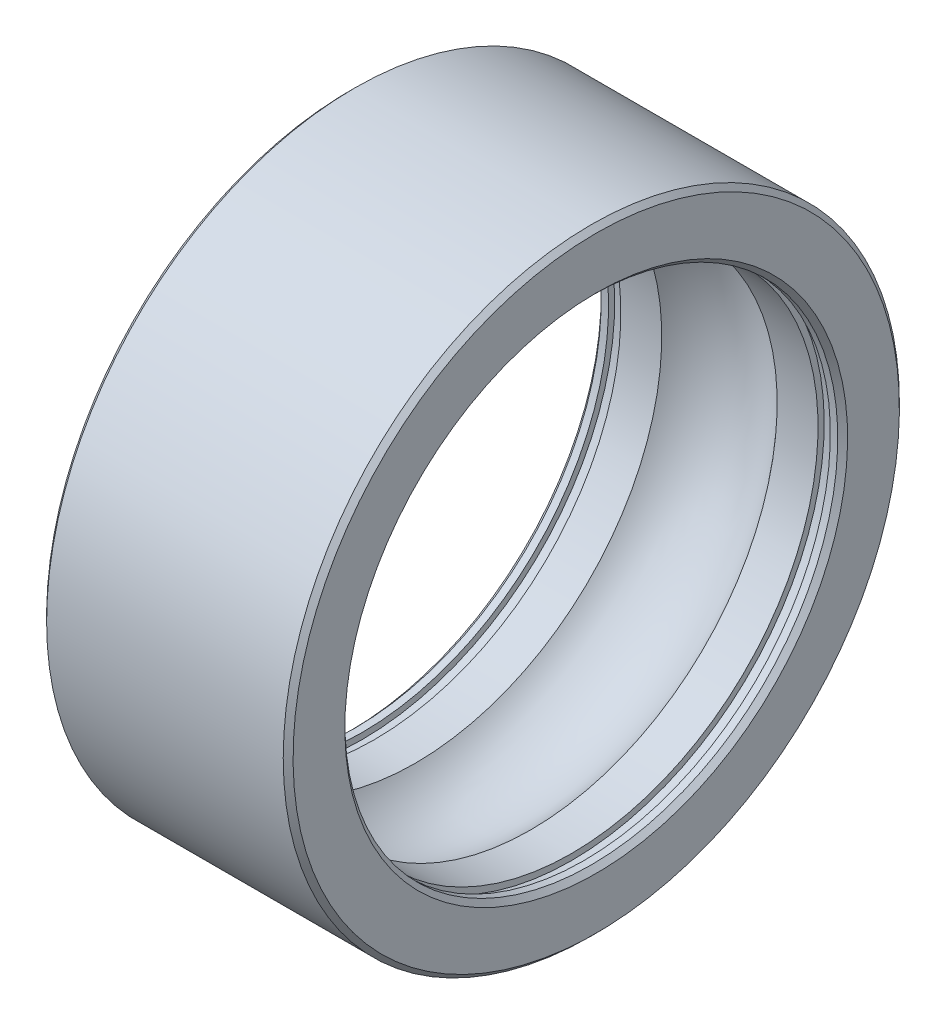
ISO-10303-21;
HEADER;
FILE_DESCRIPTION(('STEP AP214'),'2;1');
FILE_NAME('part.step','',(''),(''),'','','');
FILE_SCHEMA(('AUTOMOTIVE_DESIGN { 1 0 10303 214 1 1 1 1 }'));
ENDSEC;
DATA;
#1=APPLICATION_CONTEXT('core data for automotive mechanical design processes');
#2=APPLICATION_PROTOCOL_DEFINITION('international standard','automotive_design',2000,#1);
#3=PRODUCT_CONTEXT('',#1,'mechanical');
#4=PRODUCT('Part','Part','',(#3));
#5=PRODUCT_RELATED_PRODUCT_CATEGORY('part','',(#4));
#6=PRODUCT_DEFINITION_FORMATION('','',#4);
#7=PRODUCT_DEFINITION_CONTEXT('part definition',#1,'design');
#8=PRODUCT_DEFINITION('design','',#6,#7);
#9=PRODUCT_DEFINITION_SHAPE('','',#8);
#10=(LENGTH_UNIT() NAMED_UNIT(*) SI_UNIT(.MILLI.,.METRE.));
#11=(NAMED_UNIT(*) PLANE_ANGLE_UNIT() SI_UNIT($,.RADIAN.));
#12=(NAMED_UNIT(*) SI_UNIT($,.STERADIAN.) SOLID_ANGLE_UNIT());
#13=UNCERTAINTY_MEASURE_WITH_UNIT(LENGTH_MEASURE(1.E-05),#10,'distance_accuracy_value','');
#14=(GEOMETRIC_REPRESENTATION_CONTEXT(3) GLOBAL_UNCERTAINTY_ASSIGNED_CONTEXT((#13)) GLOBAL_UNIT_ASSIGNED_CONTEXT((#10,
#11,#12)) REPRESENTATION_CONTEXT('',''));
#15=CARTESIAN_POINT('',(0.,0.,0.));
#16=DIRECTION('',(0.,0.,1.));
#17=DIRECTION('',(1.,0.,0.));
#18=AXIS2_PLACEMENT_3D('',#15,#16,#17);
#19=CARTESIAN_POINT('',(1.8,-4.1,0.));
#20=DIRECTION('',(-1.,0.,0.));
#21=DIRECTION('',(0.,-1.,0.));
#22=AXIS2_PLACEMENT_3D('',#19,#20,#21);
#23=PLANE('',#22);
#24=CARTESIAN_POINT('',(1.8,0.,0.));
#25=DIRECTION('',(-1.,0.,0.));
#26=DIRECTION('',(0.,-1.,0.));
#27=AXIS2_PLACEMENT_3D('',#24,#25,#26);
#28=CIRCLE('',#27,4.1);
#29=CARTESIAN_POINT('',(1.8,-4.1,0.));
#30=VERTEX_POINT('',#29);
#31=EDGE_CURVE('E62',#30,#30,#28,.T.);
#32=ORIENTED_EDGE('',*,*,#31,.T.);
#33=EDGE_LOOP('',(#32));
#34=FACE_BOUND('',#33,.T.);
#35=CARTESIAN_POINT('',(1.8,0.,0.));
#36=DIRECTION('',(-1.,0.,0.));
#37=DIRECTION('',(0.,-1.,0.));
#38=AXIS2_PLACEMENT_3D('',#35,#36,#37);
#39=CIRCLE('',#38,4.);
#40=CARTESIAN_POINT('',(1.8,-4.,0.));
#41=VERTEX_POINT('',#40);
#42=EDGE_CURVE('E89',#41,#41,#39,.T.);
#43=ORIENTED_EDGE('',*,*,#42,.F.);
#44=EDGE_LOOP('',(#43));
#45=FACE_BOUND('',#44,.T.);
#46=ADVANCED_FACE('F30',(#34,#45),#23,.T.);
#47=CARTESIAN_POINT('',(-6.42901749222422,0.,0.));
#48=DIRECTION('',(-1.,0.,0.));
#49=DIRECTION('',(0.,-1.,0.));
#50=AXIS2_PLACEMENT_3D('',#47,#48,#49);
#51=CYLINDRICAL_SURFACE('',#50,4.1);
#52=CARTESIAN_POINT('',(1.6,0.,0.));
#53=DIRECTION('',(-1.,0.,0.));
#54=DIRECTION('',(0.,-1.,0.));
#55=AXIS2_PLACEMENT_3D('',#52,#53,#54);
#56=CIRCLE('',#55,4.1);
#57=CARTESIAN_POINT('',(1.6,-4.1,0.));
#58=VERTEX_POINT('',#57);
#59=EDGE_CURVE('E65',#58,#58,#56,.T.);
#60=ORIENTED_EDGE('',*,*,#59,.T.);
#61=EDGE_LOOP('',(#60));
#62=FACE_BOUND('',#61,.T.);
#63=ORIENTED_EDGE('',*,*,#31,.F.);
#64=EDGE_LOOP('',(#63));
#65=FACE_BOUND('',#64,.T.);
#66=ADVANCED_FACE('F96',(#62,#65),#51,.F.);
#67=CARTESIAN_POINT('',(1.6,-4.,0.));
#68=DIRECTION('',(1.,0.,0.));
#69=DIRECTION('',(0.,1.,0.));
#70=AXIS2_PLACEMENT_3D('',#67,#68,#69);
#71=PLANE('',#70);
#72=CARTESIAN_POINT('',(1.6,0.,0.));
#73=DIRECTION('',(-1.,0.,0.));
#74=DIRECTION('',(0.,-1.,0.));
#75=AXIS2_PLACEMENT_3D('',#72,#73,#74);
#76=CIRCLE('',#75,4.);
#77=CARTESIAN_POINT('',(1.6,-4.,0.));
#78=VERTEX_POINT('',#77);
#79=EDGE_CURVE('E68',#78,#78,#76,.T.);
#80=ORIENTED_EDGE('',*,*,#79,.T.);
#81=EDGE_LOOP('',(#80));
#82=FACE_BOUND('',#81,.T.);
#83=ORIENTED_EDGE('',*,*,#59,.F.);
#84=EDGE_LOOP('',(#83));
#85=FACE_BOUND('',#84,.T.);
#86=ADVANCED_FACE('F102',(#82,#85),#71,.T.);
#87=CARTESIAN_POINT('',(-6.42901749222422,0.,0.));
#88=DIRECTION('',(-1.,0.,0.));
#89=DIRECTION('',(0.,-1.,0.));
#90=AXIS2_PLACEMENT_3D('',#87,#88,#89);
#91=CYLINDRICAL_SURFACE('',#90,4.);
#92=CARTESIAN_POINT('',(0.936749699759759,0.,0.));
#93=DIRECTION('',(-1.,0.,0.));
#94=DIRECTION('',(0.,-1.,0.));
#95=AXIS2_PLACEMENT_3D('',#92,#93,#94);
#96=CIRCLE('',#95,4.);
#97=CARTESIAN_POINT('',(0.936749699759759,-4.,0.));
#98=VERTEX_POINT('',#97);
#99=EDGE_CURVE('E71',#98,#98,#96,.T.);
#100=ORIENTED_EDGE('',*,*,#99,.T.);
#101=EDGE_LOOP('',(#100));
#102=FACE_BOUND('',#101,.T.);
#103=ORIENTED_EDGE('',*,*,#79,.F.);
#104=EDGE_LOOP('',(#103));
#105=FACE_BOUND('',#104,.T.);
#106=ADVANCED_FACE('F164',(#102,#105),#91,.F.);
#107=CARTESIAN_POINT('',(0.,0.,0.));
#108=DIRECTION('',(-1.,0.,0.));
#109=DIRECTION('',(0.,-1.,0.));
#110=AXIS2_PLACEMENT_3D('',#107,#108,#109);
#111=TOROIDAL_SURFACE('',#110,3.25,1.2);
#112=CARTESIAN_POINT('',(-0.93674969975976,0.,0.));
#113=DIRECTION('',(-1.,0.,0.));
#114=DIRECTION('',(0.,-1.,0.));
#115=AXIS2_PLACEMENT_3D('',#112,#113,#114);
#116=CIRCLE('',#115,4.);
#117=CARTESIAN_POINT('',(-0.93674969975976,-4.,0.));
#118=VERTEX_POINT('',#117);
#119=EDGE_CURVE('E74',#118,#118,#116,.T.);
#120=ORIENTED_EDGE('',*,*,#119,.T.);
#121=EDGE_LOOP('',(#120));
#122=FACE_BOUND('',#121,.T.);
#123=ORIENTED_EDGE('',*,*,#99,.F.);
#124=EDGE_LOOP('',(#123));
#125=FACE_BOUND('',#124,.T.);
#126=ADVANCED_FACE('F160',(#122,#125),#111,.F.);
#127=CARTESIAN_POINT('',(-6.42901749222422,0.,0.));
#128=DIRECTION('',(-1.,0.,0.));
#129=DIRECTION('',(0.,-1.,0.));
#130=AXIS2_PLACEMENT_3D('',#127,#128,#129);
#131=CYLINDRICAL_SURFACE('',#130,4.);
#132=CARTESIAN_POINT('',(-1.6,0.,0.));
#133=DIRECTION('',(-1.,0.,0.));
#134=DIRECTION('',(0.,-1.,0.));
#135=AXIS2_PLACEMENT_3D('',#132,#133,#134);
#136=CIRCLE('',#135,4.);
#137=CARTESIAN_POINT('',(-1.6,-4.,0.));
#138=VERTEX_POINT('',#137);
#139=EDGE_CURVE('E77',#138,#138,#136,.T.);
#140=ORIENTED_EDGE('',*,*,#139,.T.);
#141=EDGE_LOOP('',(#140));
#142=FACE_BOUND('',#141,.T.);
#143=ORIENTED_EDGE('',*,*,#119,.F.);
#144=EDGE_LOOP('',(#143));
#145=FACE_BOUND('',#144,.T.);
#146=ADVANCED_FACE('F156',(#142,#145),#131,.F.);
#147=CARTESIAN_POINT('',(-1.6,-4.,0.));
#148=DIRECTION('',(-1.,0.,0.));
#149=DIRECTION('',(0.,-1.,0.));
#150=AXIS2_PLACEMENT_3D('',#147,#148,#149);
#151=PLANE('',#150);
#152=CARTESIAN_POINT('',(-1.6,0.,0.));
#153=DIRECTION('',(-1.,0.,0.));
#154=DIRECTION('',(0.,-1.,0.));
#155=AXIS2_PLACEMENT_3D('',#152,#153,#154);
#156=CIRCLE('',#155,4.1);
#157=CARTESIAN_POINT('',(-1.6,-4.1,0.));
#158=VERTEX_POINT('',#157);
#159=EDGE_CURVE('E80',#158,#158,#156,.T.);
#160=ORIENTED_EDGE('',*,*,#159,.T.);
#161=EDGE_LOOP('',(#160));
#162=FACE_BOUND('',#161,.T.);
#163=ORIENTED_EDGE('',*,*,#139,.F.);
#164=EDGE_LOOP('',(#163));
#165=FACE_BOUND('',#164,.T.);
#166=ADVANCED_FACE('F152',(#162,#165),#151,.T.);
#167=CARTESIAN_POINT('',(-6.42901749222422,0.,0.));
#168=DIRECTION('',(-1.,0.,0.));
#169=DIRECTION('',(0.,-1.,0.));
#170=AXIS2_PLACEMENT_3D('',#167,#168,#169);
#171=CYLINDRICAL_SURFACE('',#170,4.1);
#172=CARTESIAN_POINT('',(-1.8,0.,0.));
#173=DIRECTION('',(-1.,0.,0.));
#174=DIRECTION('',(0.,-1.,0.));
#175=AXIS2_PLACEMENT_3D('',#172,#173,#174);
#176=CIRCLE('',#175,4.1);
#177=CARTESIAN_POINT('',(-1.8,-4.1,0.));
#178=VERTEX_POINT('',#177);
#179=EDGE_CURVE('E83',#178,#178,#176,.T.);
#180=ORIENTED_EDGE('',*,*,#179,.T.);
#181=EDGE_LOOP('',(#180));
#182=FACE_BOUND('',#181,.T.);
#183=ORIENTED_EDGE('',*,*,#159,.F.);
#184=EDGE_LOOP('',(#183));
#185=FACE_BOUND('',#184,.T.);
#186=ADVANCED_FACE('F148',(#182,#185),#171,.F.);
#187=CARTESIAN_POINT('',(-1.8,-4.1,0.));
#188=DIRECTION('',(1.,0.,0.));
#189=DIRECTION('',(0.,1.,0.));
#190=AXIS2_PLACEMENT_3D('',#187,#188,#189);
#191=PLANE('',#190);
#192=CARTESIAN_POINT('',(-1.8,0.,0.));
#193=DIRECTION('',(-1.,0.,0.));
#194=DIRECTION('',(0.,-1.,0.));
#195=AXIS2_PLACEMENT_3D('',#192,#193,#194);
#196=CIRCLE('',#195,4.);
#197=CARTESIAN_POINT('',(-1.8,-4.,0.));
#198=VERTEX_POINT('',#197);
#199=EDGE_CURVE('E86',#198,#198,#196,.T.);
#200=ORIENTED_EDGE('',*,*,#199,.T.);
#201=EDGE_LOOP('',(#200));
#202=FACE_BOUND('',#201,.T.);
#203=ORIENTED_EDGE('',*,*,#179,.F.);
#204=EDGE_LOOP('',(#203));
#205=FACE_BOUND('',#204,.T.);
#206=ADVANCED_FACE('F144',(#202,#205),#191,.T.);
#207=CARTESIAN_POINT('',(-6.42901749222422,0.,0.));
#208=DIRECTION('',(-1.,0.,0.));
#209=DIRECTION('',(0.,-1.,0.));
#210=AXIS2_PLACEMENT_3D('',#207,#208,#209);
#211=CYLINDRICAL_SURFACE('',#210,4.);
#212=CARTESIAN_POINT('',(-1.92,0.,0.));
#213=DIRECTION('',(-1.,0.,0.));
#214=DIRECTION('',(0.,-1.,0.));
#215=AXIS2_PLACEMENT_3D('',#212,#213,#214);
#216=CIRCLE('',#215,4.);
#217=CARTESIAN_POINT('',(-1.92,-4.,0.));
#218=VERTEX_POINT('',#217);
#219=EDGE_CURVE('E50',#218,#218,#216,.T.);
#220=ORIENTED_EDGE('',*,*,#219,.T.);
#221=EDGE_LOOP('',(#220));
#222=FACE_BOUND('',#221,.T.);
#223=ORIENTED_EDGE('',*,*,#199,.F.);
#224=EDGE_LOOP('',(#223));
#225=FACE_BOUND('',#224,.T.);
#226=ADVANCED_FACE('F140',(#222,#225),#211,.F.);
#227=CARTESIAN_POINT('',(-2.,-4.,0.));
#228=DIRECTION('',(-1.,0.,0.));
#229=DIRECTION('',(0.,-1.,0.));
#230=AXIS2_PLACEMENT_3D('',#227,#228,#229);
#231=PLANE('',#230);
#232=CARTESIAN_POINT('',(-2.,0.,0.));
#233=DIRECTION('',(-1.,0.,0.));
#234=DIRECTION('',(0.,-1.,0.));
#235=AXIS2_PLACEMENT_3D('',#232,#233,#234);
#236=CIRCLE('',#235,4.08);
#237=CARTESIAN_POINT('',(-2.,-4.08,0.));
#238=VERTEX_POINT('',#237);
#239=EDGE_CURVE('E41',#238,#238,#236,.F.);
#240=ORIENTED_EDGE('',*,*,#239,.T.);
#241=EDGE_LOOP('',(#240));
#242=FACE_BOUND('',#241,.T.);
#243=CARTESIAN_POINT('',(-2.,0.,0.));
#244=DIRECTION('',(-1.,0.,0.));
#245=DIRECTION('',(0.,-1.,0.));
#246=AXIS2_PLACEMENT_3D('',#243,#244,#245);
#247=CIRCLE('',#246,4.91999999999999);
#248=CARTESIAN_POINT('',(-2.,-4.91999999999999,0.));
#249=VERTEX_POINT('',#248);
#250=EDGE_CURVE('E45',#249,#249,#247,.T.);
#251=ORIENTED_EDGE('',*,*,#250,.T.);
#252=EDGE_LOOP('',(#251));
#253=FACE_BOUND('',#252,.T.);
#254=ADVANCED_FACE('F135',(#242,#253),#231,.T.);
#255=CARTESIAN_POINT('',(-6.42901749222422,0.,0.));
#256=DIRECTION('',(-1.,0.,0.));
#257=DIRECTION('',(0.,-1.,0.));
#258=AXIS2_PLACEMENT_3D('',#255,#256,#257);
#259=CYLINDRICAL_SURFACE('',#258,5.);
#260=CARTESIAN_POINT('',(1.92,0.,0.));
#261=DIRECTION('',(1.,0.,0.));
#262=DIRECTION('',(0.,1.,0.));
#263=AXIS2_PLACEMENT_3D('',#260,#261,#262);
#264=CIRCLE('',#263,5.);
#265=CARTESIAN_POINT('',(1.92,5.,0.));
#266=VERTEX_POINT('',#265);
#267=EDGE_CURVE('E10',#266,#266,#264,.F.);
#268=ORIENTED_EDGE('',*,*,#267,.T.);
#269=EDGE_LOOP('',(#268));
#270=FACE_BOUND('',#269,.T.);
#271=CARTESIAN_POINT('',(-1.91999999999999,0.,0.));
#272=DIRECTION('',(-1.,0.,0.));
#273=DIRECTION('',(0.,-1.,0.));
#274=AXIS2_PLACEMENT_3D('',#271,#272,#273);
#275=CIRCLE('',#274,5.);
#276=CARTESIAN_POINT('',(-1.91999999999999,-5.,0.));
#277=VERTEX_POINT('',#276);
#278=EDGE_CURVE('E37',#277,#277,#275,.F.);
#279=ORIENTED_EDGE('',*,*,#278,.T.);
#280=EDGE_LOOP('',(#279));
#281=FACE_BOUND('',#280,.T.);
#282=ADVANCED_FACE('F126',(#270,#281),#259,.T.);
#283=CARTESIAN_POINT('',(2.,-4.,0.));
#284=DIRECTION('',(1.,0.,0.));
#285=DIRECTION('',(0.,1.,0.));
#286=AXIS2_PLACEMENT_3D('',#283,#284,#285);
#287=PLANE('',#286);
#288=CARTESIAN_POINT('',(2.,0.,0.));
#289=DIRECTION('',(1.,0.,0.));
#290=DIRECTION('',(0.,1.,0.));
#291=AXIS2_PLACEMENT_3D('',#288,#289,#290);
#292=CIRCLE('',#291,4.08);
#293=CARTESIAN_POINT('',(2.,4.08,0.));
#294=VERTEX_POINT('',#293);
#295=EDGE_CURVE('E56',#294,#294,#292,.F.);
#296=ORIENTED_EDGE('',*,*,#295,.T.);
#297=EDGE_LOOP('',(#296));
#298=FACE_BOUND('',#297,.T.);
#299=CARTESIAN_POINT('',(2.,0.,0.));
#300=DIRECTION('',(1.,0.,0.));
#301=DIRECTION('',(0.,1.,0.));
#302=AXIS2_PLACEMENT_3D('',#299,#300,#301);
#303=CIRCLE('',#302,4.92);
#304=CARTESIAN_POINT('',(2.,4.92,0.));
#305=VERTEX_POINT('',#304);
#306=EDGE_CURVE('E59',#305,#305,#303,.T.);
#307=ORIENTED_EDGE('',*,*,#306,.T.);
#308=EDGE_LOOP('',(#307));
#309=FACE_BOUND('',#308,.T.);
#310=ADVANCED_FACE('F124',(#298,#309),#287,.T.);
#311=CARTESIAN_POINT('',(-6.42901749222422,0.,0.));
#312=DIRECTION('',(-1.,0.,0.));
#313=DIRECTION('',(0.,-1.,0.));
#314=AXIS2_PLACEMENT_3D('',#311,#312,#313);
#315=CYLINDRICAL_SURFACE('',#314,4.);
#316=CARTESIAN_POINT('',(1.92,0.,0.));
#317=DIRECTION('',(1.,0.,0.));
#318=DIRECTION('',(0.,1.,0.));
#319=AXIS2_PLACEMENT_3D('',#316,#317,#318);
#320=CIRCLE('',#319,4.);
#321=CARTESIAN_POINT('',(1.92,4.,0.));
#322=VERTEX_POINT('',#321);
#323=EDGE_CURVE('E53',#322,#322,#320,.T.);
#324=ORIENTED_EDGE('',*,*,#323,.T.);
#325=EDGE_LOOP('',(#324));
#326=FACE_BOUND('',#325,.T.);
#327=ORIENTED_EDGE('',*,*,#42,.T.);
#328=EDGE_LOOP('',(#327));
#329=FACE_BOUND('',#328,.T.);
#330=ADVANCED_FACE('F93',(#326,#329),#315,.F.);
#331=CARTESIAN_POINT('',(2.,0.,0.));
#332=DIRECTION('',(1.,0.,0.));
#333=DIRECTION('',(0.,1.,0.));
#334=AXIS2_PLACEMENT_3D('',#331,#332,#333);
#335=CONICAL_SURFACE('',#334,4.08,0.785398163397448);
#336=ORIENTED_EDGE('',*,*,#323,.F.);
#337=EDGE_LOOP('',(#336));
#338=FACE_BOUND('',#337,.T.);
#339=ORIENTED_EDGE('',*,*,#295,.F.);
#340=EDGE_LOOP('',(#339));
#341=FACE_BOUND('',#340,.T.);
#342=ADVANCED_FACE('F107',(#338,#341),#335,.F.);
#343=CARTESIAN_POINT('',(-1.92,0.,0.));
#344=DIRECTION('',(-1.,0.,0.));
#345=DIRECTION('',(0.,-1.,0.));
#346=AXIS2_PLACEMENT_3D('',#343,#344,#345);
#347=CONICAL_SURFACE('',#346,4.,0.785398163397459);
#348=ORIENTED_EDGE('',*,*,#239,.F.);
#349=EDGE_LOOP('',(#348));
#350=FACE_BOUND('',#349,.T.);
#351=ORIENTED_EDGE('',*,*,#219,.F.);
#352=EDGE_LOOP('',(#351));
#353=FACE_BOUND('',#352,.T.);
#354=ADVANCED_FACE('F110',(#350,#353),#347,.F.);
#355=CARTESIAN_POINT('',(1.92,0.,0.));
#356=DIRECTION('',(-1.,0.,0.));
#357=DIRECTION('',(0.,-1.,0.));
#358=AXIS2_PLACEMENT_3D('',#355,#356,#357);
#359=CONICAL_SURFACE('',#358,5.,0.785398163397448);
#360=ORIENTED_EDGE('',*,*,#306,.F.);
#361=EDGE_LOOP('',(#360));
#362=FACE_BOUND('',#361,.T.);
#363=ORIENTED_EDGE('',*,*,#267,.F.);
#364=EDGE_LOOP('',(#363));
#365=FACE_BOUND('',#364,.T.);
#366=ADVANCED_FACE('F113',(#362,#365),#359,.T.);
#367=CARTESIAN_POINT('',(-2.,0.,0.));
#368=DIRECTION('',(1.,0.,0.));
#369=DIRECTION('',(0.,1.,0.));
#370=AXIS2_PLACEMENT_3D('',#367,#368,#369);
#371=CONICAL_SURFACE('',#370,4.91999999999999,0.785398163397443);
#372=ORIENTED_EDGE('',*,*,#278,.F.);
#373=EDGE_LOOP('',(#372));
#374=FACE_BOUND('',#373,.T.);
#375=ORIENTED_EDGE('',*,*,#250,.F.);
#376=EDGE_LOOP('',(#375));
#377=FACE_BOUND('',#376,.T.);
#378=ADVANCED_FACE('F32',(#374,#377),#371,.T.);
#379=CLOSED_SHELL('',(#46,#66,#86,#106,#126,#146,#166,#186,#206,#226,#254,#282,#310,#330,#342,
#354,#366,#378));
#380=MANIFOLD_SOLID_BREP('B2',#379);
#381=ADVANCED_BREP_SHAPE_REPRESENTATION('',(#18,#380),#14);
#382=SHAPE_DEFINITION_REPRESENTATION(#9,#381);
ENDSEC;
END-ISO-10303-21;
